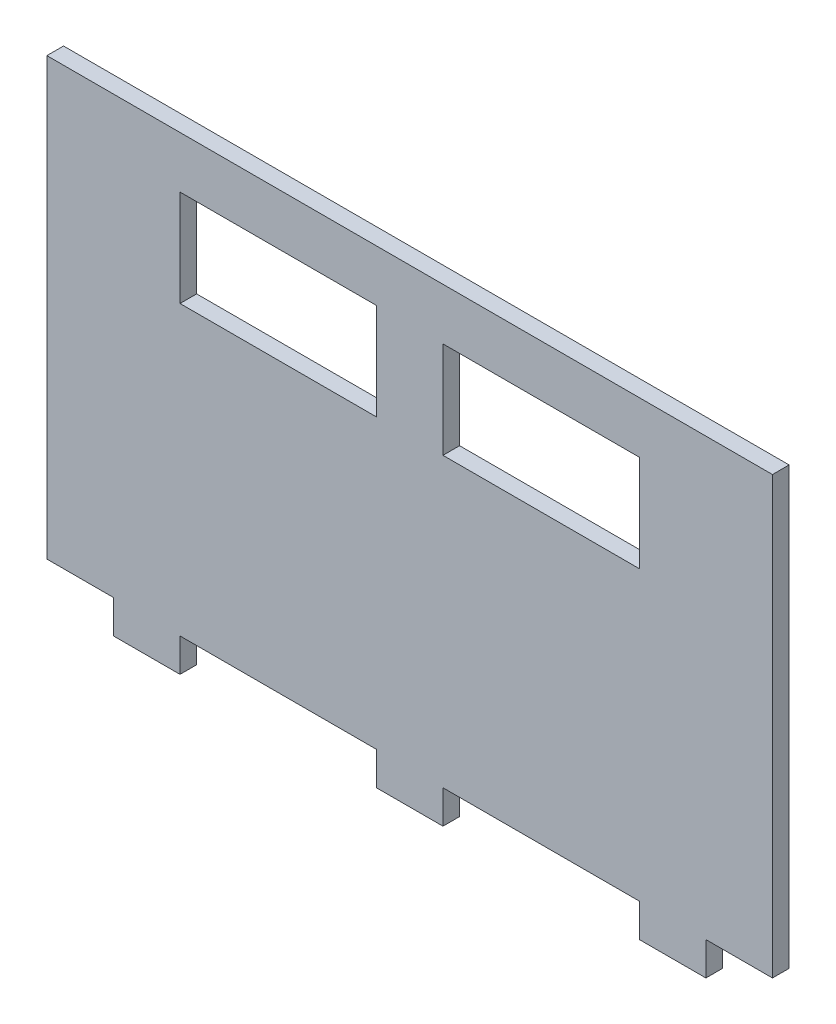
ISO-10303-21;
HEADER;
FILE_DESCRIPTION(('STEP AP214'),'2;1');
FILE_NAME('part.step','',(''),(''),'','','');
FILE_SCHEMA(('AUTOMOTIVE_DESIGN { 1 0 10303 214 1 1 1 1 }'));
ENDSEC;
DATA;
#1=APPLICATION_CONTEXT('core data for automotive mechanical design processes');
#2=APPLICATION_PROTOCOL_DEFINITION('international standard','automotive_design',2000,#1);
#3=PRODUCT_CONTEXT('',#1,'mechanical');
#4=PRODUCT('Part','Part','',(#3));
#5=PRODUCT_RELATED_PRODUCT_CATEGORY('part','',(#4));
#6=PRODUCT_DEFINITION_FORMATION('','',#4);
#7=PRODUCT_DEFINITION_CONTEXT('part definition',#1,'design');
#8=PRODUCT_DEFINITION('design','',#6,#7);
#9=PRODUCT_DEFINITION_SHAPE('','',#8);
#10=(LENGTH_UNIT() NAMED_UNIT(*) SI_UNIT(.MILLI.,.METRE.));
#11=(NAMED_UNIT(*) PLANE_ANGLE_UNIT() SI_UNIT($,.RADIAN.));
#12=(NAMED_UNIT(*) SI_UNIT($,.STERADIAN.) SOLID_ANGLE_UNIT());
#13=UNCERTAINTY_MEASURE_WITH_UNIT(LENGTH_MEASURE(1.E-05),#10,'distance_accuracy_value','');
#14=(GEOMETRIC_REPRESENTATION_CONTEXT(3) GLOBAL_UNCERTAINTY_ASSIGNED_CONTEXT((#13)) GLOBAL_UNIT_ASSIGNED_CONTEXT((#10,
#11,#12)) REPRESENTATION_CONTEXT('',''));
#15=CARTESIAN_POINT('',(0.,0.,0.));
#16=DIRECTION('',(0.,0.,1.));
#17=DIRECTION('',(1.,0.,0.));
#18=AXIS2_PLACEMENT_3D('',#15,#16,#17);
#19=CARTESIAN_POINT('',(0.,49.9999999999999,5.));
#20=DIRECTION('',(0.,1.,0.));
#21=DIRECTION('',(-1.,0.,0.));
#22=AXIS2_PLACEMENT_3D('',#19,#20,#21);
#23=PLANE('',#22);
#24=DIRECTION('',(1.,0.,0.));
#25=VECTOR('',#24,1.);
#26=CARTESIAN_POINT('',(0.,49.9999999999999,0.));
#27=LINE('',#26,#25);
#28=CARTESIAN_POINT('',(9.99999999999999,49.9999999999999,0.));
#29=VERTEX_POINT('',#28);
#30=CARTESIAN_POINT('',(69.,49.9999999999999,0.));
#31=VERTEX_POINT('',#30);
#32=EDGE_CURVE('E278',#29,#31,#27,.T.);
#33=ORIENTED_EDGE('',*,*,#32,.T.);
#34=DIRECTION('',(0.,0.,-1.));
#35=VECTOR('',#34,1.);
#36=CARTESIAN_POINT('',(69.,49.9999999999999,5.));
#37=LINE('',#36,#35);
#38=CARTESIAN_POINT('',(69.,49.9999999999999,5.));
#39=VERTEX_POINT('',#38);
#40=EDGE_CURVE('E11',#39,#31,#37,.T.);
#41=ORIENTED_EDGE('',*,*,#40,.F.);
#42=DIRECTION('',(1.,0.,0.));
#43=VECTOR('',#42,1.);
#44=CARTESIAN_POINT('',(0.,49.9999999999999,5.));
#45=LINE('',#44,#43);
#46=CARTESIAN_POINT('',(9.99999999999999,49.9999999999999,5.));
#47=VERTEX_POINT('',#46);
#48=EDGE_CURVE('E208',#47,#39,#45,.T.);
#49=ORIENTED_EDGE('',*,*,#48,.F.);
#50=DIRECTION('',(0.,0.,-1.));
#51=VECTOR('',#50,1.);
#52=CARTESIAN_POINT('',(9.99999999999999,49.9999999999999,5.));
#53=LINE('',#52,#51);
#54=EDGE_CURVE('E52',#47,#29,#53,.T.);
#55=ORIENTED_EDGE('',*,*,#54,.T.);
#56=EDGE_LOOP('',(#33,#41,#49,#55));
#57=FACE_BOUND('',#56,.T.);
#58=ADVANCED_FACE('F33',(#57),#23,.F.);
#59=CARTESIAN_POINT('',(69.,0.,5.));
#60=DIRECTION('',(1.,0.,0.));
#61=DIRECTION('',(0.,0.,-1.));
#62=AXIS2_PLACEMENT_3D('',#59,#60,#61);
#63=PLANE('',#62);
#64=DIRECTION('',(0.,-1.,0.));
#65=VECTOR('',#64,1.);
#66=CARTESIAN_POINT('',(69.,0.,0.));
#67=LINE('',#66,#65);
#68=CARTESIAN_POINT('',(69.,21.,0.));
#69=VERTEX_POINT('',#68);
#70=EDGE_CURVE('E214',#31,#69,#67,.T.);
#71=ORIENTED_EDGE('',*,*,#70,.T.);
#72=DIRECTION('',(0.,0.,-1.));
#73=VECTOR('',#72,1.);
#74=CARTESIAN_POINT('',(69.,21.,5.));
#75=LINE('',#74,#73);
#76=CARTESIAN_POINT('',(69.,21.,5.));
#77=VERTEX_POINT('',#76);
#78=EDGE_CURVE('E43',#77,#69,#75,.T.);
#79=ORIENTED_EDGE('',*,*,#78,.F.);
#80=DIRECTION('',(0.,-1.,0.));
#81=VECTOR('',#80,1.);
#82=CARTESIAN_POINT('',(69.,0.,5.));
#83=LINE('',#82,#81);
#84=EDGE_CURVE('E202',#39,#77,#83,.T.);
#85=ORIENTED_EDGE('',*,*,#84,.F.);
#86=ORIENTED_EDGE('',*,*,#40,.T.);
#87=EDGE_LOOP('',(#71,#79,#85,#86));
#88=FACE_BOUND('',#87,.T.);
#89=ADVANCED_FACE('F213',(#88),#63,.F.);
#90=CARTESIAN_POINT('',(0.,21.,5.));
#91=DIRECTION('',(0.,1.,0.));
#92=DIRECTION('',(0.,0.,1.));
#93=AXIS2_PLACEMENT_3D('',#90,#91,#92);
#94=PLANE('',#93);
#95=DIRECTION('',(1.,0.,0.));
#96=VECTOR('',#95,1.);
#97=CARTESIAN_POINT('',(0.,21.,0.));
#98=LINE('',#97,#96);
#99=CARTESIAN_POINT('',(10.,21.,0.));
#100=VERTEX_POINT('',#99);
#101=EDGE_CURVE('E281',#100,#69,#98,.T.);
#102=ORIENTED_EDGE('',*,*,#101,.F.);
#103=DIRECTION('',(0.,0.,-1.));
#104=VECTOR('',#103,1.);
#105=CARTESIAN_POINT('',(10.,21.,5.));
#106=LINE('',#105,#104);
#107=CARTESIAN_POINT('',(10.,21.,5.));
#108=VERTEX_POINT('',#107);
#109=EDGE_CURVE('E126',#108,#100,#106,.T.);
#110=ORIENTED_EDGE('',*,*,#109,.F.);
#111=DIRECTION('',(1.,0.,0.));
#112=VECTOR('',#111,1.);
#113=CARTESIAN_POINT('',(0.,21.,5.));
#114=LINE('',#113,#112);
#115=EDGE_CURVE('E207',#108,#77,#114,.T.);
#116=ORIENTED_EDGE('',*,*,#115,.T.);
#117=ORIENTED_EDGE('',*,*,#78,.T.);
#118=EDGE_LOOP('',(#102,#110,#116,#117));
#119=FACE_BOUND('',#118,.T.);
#120=ADVANCED_FACE('F218',(#119),#94,.T.);
#121=CARTESIAN_POINT('',(109.,0.,5.));
#122=DIRECTION('',(1.,0.,0.));
#123=DIRECTION('',(0.,1.,0.));
#124=AXIS2_PLACEMENT_3D('',#121,#122,#123);
#125=PLANE('',#124);
#126=DIRECTION('',(0.,-1.,0.));
#127=VECTOR('',#126,1.);
#128=CARTESIAN_POINT('',(109.,0.,0.));
#129=LINE('',#128,#127);
#130=CARTESIAN_POINT('',(109.,65.5,0.));
#131=VERTEX_POINT('',#130);
#132=CARTESIAN_POINT('',(109.,-65.5,0.));
#133=VERTEX_POINT('',#132);
#134=EDGE_CURVE('E236',#131,#133,#129,.T.);
#135=ORIENTED_EDGE('',*,*,#134,.F.);
#136=DIRECTION('',(0.,0.,-1.));
#137=VECTOR('',#136,1.);
#138=CARTESIAN_POINT('',(109.,65.5,5.));
#139=LINE('',#138,#137);
#140=CARTESIAN_POINT('',(109.,65.5,5.));
#141=VERTEX_POINT('',#140);
#142=EDGE_CURVE('E288',#141,#131,#139,.T.);
#143=ORIENTED_EDGE('',*,*,#142,.F.);
#144=DIRECTION('',(0.,-1.,0.));
#145=VECTOR('',#144,1.);
#146=CARTESIAN_POINT('',(109.,0.,5.));
#147=LINE('',#146,#145);
#148=CARTESIAN_POINT('',(109.,-65.5,5.));
#149=VERTEX_POINT('',#148);
#150=EDGE_CURVE('E353',#141,#149,#147,.T.);
#151=ORIENTED_EDGE('',*,*,#150,.T.);
#152=DIRECTION('',(0.,0.,-1.));
#153=VECTOR('',#152,1.);
#154=CARTESIAN_POINT('',(109.,-65.5,5.));
#155=LINE('',#154,#153);
#156=EDGE_CURVE('E290',#149,#133,#155,.T.);
#157=ORIENTED_EDGE('',*,*,#156,.T.);
#158=EDGE_LOOP('',(#135,#143,#151,#157));
#159=FACE_BOUND('',#158,.T.);
#160=ADVANCED_FACE('F441',(#159),#125,.T.);
#161=CARTESIAN_POINT('',(0.,65.5,5.));
#162=DIRECTION('',(0.,1.,0.));
#163=DIRECTION('',(0.,0.,1.));
#164=AXIS2_PLACEMENT_3D('',#161,#162,#163);
#165=PLANE('',#164);
#166=DIRECTION('',(1.,0.,0.));
#167=VECTOR('',#166,1.);
#168=CARTESIAN_POINT('',(0.,65.5,0.));
#169=LINE('',#168,#167);
#170=CARTESIAN_POINT('',(-109.,65.5,0.));
#171=VERTEX_POINT('',#170);
#172=EDGE_CURVE('E239',#171,#131,#169,.T.);
#173=ORIENTED_EDGE('',*,*,#172,.F.);
#174=DIRECTION('',(0.,0.,-1.));
#175=VECTOR('',#174,1.);
#176=CARTESIAN_POINT('',(-109.,65.5,5.));
#177=LINE('',#176,#175);
#178=CARTESIAN_POINT('',(-109.,65.5,5.));
#179=VERTEX_POINT('',#178);
#180=EDGE_CURVE('E325',#179,#171,#177,.T.);
#181=ORIENTED_EDGE('',*,*,#180,.F.);
#182=DIRECTION('',(1.,0.,0.));
#183=VECTOR('',#182,1.);
#184=CARTESIAN_POINT('',(0.,65.5,5.));
#185=LINE('',#184,#183);
#186=EDGE_CURVE('E357',#179,#141,#185,.T.);
#187=ORIENTED_EDGE('',*,*,#186,.T.);
#188=ORIENTED_EDGE('',*,*,#142,.T.);
#189=EDGE_LOOP('',(#173,#181,#187,#188));
#190=FACE_BOUND('',#189,.T.);
#191=ADVANCED_FACE('F445',(#190),#165,.T.);
#192=CARTESIAN_POINT('',(-109.,0.,5.));
#193=DIRECTION('',(1.,0.,0.));
#194=DIRECTION('',(0.,1.,0.));
#195=AXIS2_PLACEMENT_3D('',#192,#193,#194);
#196=PLANE('',#195);
#197=DIRECTION('',(0.,-1.,0.));
#198=VECTOR('',#197,1.);
#199=CARTESIAN_POINT('',(-109.,0.,0.));
#200=LINE('',#199,#198);
#201=CARTESIAN_POINT('',(-109.,-65.5,0.));
#202=VERTEX_POINT('',#201);
#203=EDGE_CURVE('E242',#171,#202,#200,.T.);
#204=ORIENTED_EDGE('',*,*,#203,.T.);
#205=DIRECTION('',(0.,0.,-1.));
#206=VECTOR('',#205,1.);
#207=CARTESIAN_POINT('',(-109.,-65.5,5.));
#208=LINE('',#207,#206);
#209=CARTESIAN_POINT('',(-109.,-65.5,5.));
#210=VERTEX_POINT('',#209);
#211=EDGE_CURVE('E322',#210,#202,#208,.T.);
#212=ORIENTED_EDGE('',*,*,#211,.F.);
#213=DIRECTION('',(0.,-1.,0.));
#214=VECTOR('',#213,1.);
#215=CARTESIAN_POINT('',(-109.,0.,5.));
#216=LINE('',#215,#214);
#217=EDGE_CURVE('E364',#179,#210,#216,.T.);
#218=ORIENTED_EDGE('',*,*,#217,.F.);
#219=ORIENTED_EDGE('',*,*,#180,.T.);
#220=EDGE_LOOP('',(#204,#212,#218,#219));
#221=FACE_BOUND('',#220,.T.);
#222=ADVANCED_FACE('F450',(#221),#196,.F.);
#223=CARTESIAN_POINT('',(0.,-65.5,5.));
#224=DIRECTION('',(0.,1.,0.));
#225=DIRECTION('',(0.,0.,1.));
#226=AXIS2_PLACEMENT_3D('',#223,#224,#225);
#227=PLANE('',#226);
#228=DIRECTION('',(1.,0.,0.));
#229=VECTOR('',#228,1.);
#230=CARTESIAN_POINT('',(0.,-65.5,0.));
#231=LINE('',#230,#229);
#232=CARTESIAN_POINT('',(-89.,-65.5,0.));
#233=VERTEX_POINT('',#232);
#234=EDGE_CURVE('E245',#202,#233,#231,.T.);
#235=ORIENTED_EDGE('',*,*,#234,.T.);
#236=DIRECTION('',(0.,0.,-1.));
#237=VECTOR('',#236,1.);
#238=CARTESIAN_POINT('',(-89.,-65.5,5.));
#239=LINE('',#238,#237);
#240=CARTESIAN_POINT('',(-89.,-65.5,5.));
#241=VERTEX_POINT('',#240);
#242=EDGE_CURVE('E319',#241,#233,#239,.T.);
#243=ORIENTED_EDGE('',*,*,#242,.F.);
#244=DIRECTION('',(1.,0.,0.));
#245=VECTOR('',#244,1.);
#246=CARTESIAN_POINT('',(0.,-65.5,5.));
#247=LINE('',#246,#245);
#248=EDGE_CURVE('E367',#210,#241,#247,.T.);
#249=ORIENTED_EDGE('',*,*,#248,.F.);
#250=ORIENTED_EDGE('',*,*,#211,.T.);
#251=EDGE_LOOP('',(#235,#243,#249,#250));
#252=FACE_BOUND('',#251,.T.);
#253=ADVANCED_FACE('F454',(#252),#227,.F.);
#254=CARTESIAN_POINT('',(-89.0000000000001,-1.11022302462516E-13,5.));
#255=DIRECTION('',(1.,0.,0.));
#256=DIRECTION('',(0.,1.,0.));
#257=AXIS2_PLACEMENT_3D('',#254,#255,#256);
#258=PLANE('',#257);
#259=DIRECTION('',(0.,-1.,0.));
#260=VECTOR('',#259,1.);
#261=CARTESIAN_POINT('',(-89.0000000000001,-1.11022302462516E-13,0.));
#262=LINE('',#261,#260);
#263=CARTESIAN_POINT('',(-89.,-75.5,0.));
#264=VERTEX_POINT('',#263);
#265=EDGE_CURVE('E248',#233,#264,#262,.T.);
#266=ORIENTED_EDGE('',*,*,#265,.T.);
#267=DIRECTION('',(0.,0.,-1.));
#268=VECTOR('',#267,1.);
#269=CARTESIAN_POINT('',(-89.,-75.5,5.));
#270=LINE('',#269,#268);
#271=CARTESIAN_POINT('',(-89.,-75.5,5.));
#272=VERTEX_POINT('',#271);
#273=EDGE_CURVE('E316',#272,#264,#270,.T.);
#274=ORIENTED_EDGE('',*,*,#273,.F.);
#275=DIRECTION('',(0.,-1.,0.));
#276=VECTOR('',#275,1.);
#277=CARTESIAN_POINT('',(-89.0000000000001,-1.11022302462516E-13,5.));
#278=LINE('',#277,#276);
#279=EDGE_CURVE('E370',#241,#272,#278,.T.);
#280=ORIENTED_EDGE('',*,*,#279,.F.);
#281=ORIENTED_EDGE('',*,*,#242,.T.);
#282=EDGE_LOOP('',(#266,#274,#280,#281));
#283=FACE_BOUND('',#282,.T.);
#284=ADVANCED_FACE('F456',(#283),#258,.F.);
#285=CARTESIAN_POINT('',(0.,-75.5,5.));
#286=DIRECTION('',(0.,1.,0.));
#287=DIRECTION('',(0.,0.,1.));
#288=AXIS2_PLACEMENT_3D('',#285,#286,#287);
#289=PLANE('',#288);
#290=DIRECTION('',(1.,0.,0.));
#291=VECTOR('',#290,1.);
#292=CARTESIAN_POINT('',(0.,-75.5,0.));
#293=LINE('',#292,#291);
#294=CARTESIAN_POINT('',(-69.,-75.5,0.));
#295=VERTEX_POINT('',#294);
#296=EDGE_CURVE('E253',#264,#295,#293,.T.);
#297=ORIENTED_EDGE('',*,*,#296,.T.);
#298=DIRECTION('',(0.,0.,-1.));
#299=VECTOR('',#298,1.);
#300=CARTESIAN_POINT('',(-69.,-75.5,5.));
#301=LINE('',#300,#299);
#302=CARTESIAN_POINT('',(-69.,-75.5,5.));
#303=VERTEX_POINT('',#302);
#304=EDGE_CURVE('E314',#303,#295,#301,.T.);
#305=ORIENTED_EDGE('',*,*,#304,.F.);
#306=DIRECTION('',(1.,0.,0.));
#307=VECTOR('',#306,1.);
#308=CARTESIAN_POINT('',(0.,-75.5,5.));
#309=LINE('',#308,#307);
#310=EDGE_CURVE('E375',#272,#303,#309,.T.);
#311=ORIENTED_EDGE('',*,*,#310,.F.);
#312=ORIENTED_EDGE('',*,*,#273,.T.);
#313=EDGE_LOOP('',(#297,#305,#311,#312));
#314=FACE_BOUND('',#313,.T.);
#315=ADVANCED_FACE('F458',(#314),#289,.F.);
#316=CARTESIAN_POINT('',(-69.,0.,5.));
#317=DIRECTION('',(1.,0.,0.));
#318=DIRECTION('',(0.,0.,-1.));
#319=AXIS2_PLACEMENT_3D('',#316,#317,#318);
#320=PLANE('',#319);
#321=DIRECTION('',(0.,-1.,0.));
#322=VECTOR('',#321,1.);
#323=CARTESIAN_POINT('',(-69.,0.,0.));
#324=LINE('',#323,#322);
#325=CARTESIAN_POINT('',(-69.,-65.5,0.));
#326=VERTEX_POINT('',#325);
#327=EDGE_CURVE('E256',#326,#295,#324,.T.);
#328=ORIENTED_EDGE('',*,*,#327,.F.);
#329=DIRECTION('',(0.,0.,-1.));
#330=VECTOR('',#329,1.);
#331=CARTESIAN_POINT('',(-69.,-65.5,5.));
#332=LINE('',#331,#330);
#333=CARTESIAN_POINT('',(-69.,-65.5,5.));
#334=VERTEX_POINT('',#333);
#335=EDGE_CURVE('E312',#334,#326,#332,.T.);
#336=ORIENTED_EDGE('',*,*,#335,.F.);
#337=DIRECTION('',(0.,-1.,0.));
#338=VECTOR('',#337,1.);
#339=CARTESIAN_POINT('',(-69.,0.,5.));
#340=LINE('',#339,#338);
#341=EDGE_CURVE('E377',#334,#303,#340,.T.);
#342=ORIENTED_EDGE('',*,*,#341,.T.);
#343=ORIENTED_EDGE('',*,*,#304,.T.);
#344=EDGE_LOOP('',(#328,#336,#342,#343));
#345=FACE_BOUND('',#344,.T.);
#346=ADVANCED_FACE('F462',(#345),#320,.T.);
#347=CARTESIAN_POINT('',(-9.99999999999999,-65.5,0.));
#348=VERTEX_POINT('',#347);
#349=EDGE_CURVE('E250',#326,#348,#231,.T.);
#350=ORIENTED_EDGE('',*,*,#349,.T.);
#351=DIRECTION('',(0.,0.,-1.));
#352=VECTOR('',#351,1.);
#353=CARTESIAN_POINT('',(-9.99999999999999,-65.5,5.));
#354=LINE('',#353,#352);
#355=CARTESIAN_POINT('',(-9.99999999999999,-65.5,5.));
#356=VERTEX_POINT('',#355);
#357=EDGE_CURVE('E309',#356,#348,#354,.T.);
#358=ORIENTED_EDGE('',*,*,#357,.F.);
#359=EDGE_CURVE('E372',#334,#356,#247,.T.);
#360=ORIENTED_EDGE('',*,*,#359,.F.);
#361=ORIENTED_EDGE('',*,*,#335,.T.);
#362=EDGE_LOOP('',(#350,#358,#360,#361));
#363=FACE_BOUND('',#362,.T.);
#364=ADVANCED_FACE('F412',(#363),#227,.F.);
#365=CARTESIAN_POINT('',(-9.99999999999991,0.,5.));
#366=DIRECTION('',(1.,0.,0.));
#367=DIRECTION('',(0.,1.,0.));
#368=AXIS2_PLACEMENT_3D('',#365,#366,#367);
#369=PLANE('',#368);
#370=DIRECTION('',(0.,-1.,0.));
#371=VECTOR('',#370,1.);
#372=CARTESIAN_POINT('',(-9.99999999999991,0.,0.));
#373=LINE('',#372,#371);
#374=CARTESIAN_POINT('',(-10.,-75.5,0.));
#375=VERTEX_POINT('',#374);
#376=EDGE_CURVE('E259',#348,#375,#373,.T.);
#377=ORIENTED_EDGE('',*,*,#376,.T.);
#378=DIRECTION('',(0.,0.,-1.));
#379=VECTOR('',#378,1.);
#380=CARTESIAN_POINT('',(-10.,-75.5,5.));
#381=LINE('',#380,#379);
#382=CARTESIAN_POINT('',(-10.,-75.5,5.));
#383=VERTEX_POINT('',#382);
#384=EDGE_CURVE('E306',#383,#375,#381,.T.);
#385=ORIENTED_EDGE('',*,*,#384,.F.);
#386=DIRECTION('',(0.,-1.,0.));
#387=VECTOR('',#386,1.);
#388=CARTESIAN_POINT('',(-9.99999999999991,0.,5.));
#389=LINE('',#388,#387);
#390=EDGE_CURVE('E380',#356,#383,#389,.T.);
#391=ORIENTED_EDGE('',*,*,#390,.F.);
#392=ORIENTED_EDGE('',*,*,#357,.T.);
#393=EDGE_LOOP('',(#377,#385,#391,#392));
#394=FACE_BOUND('',#393,.T.);
#395=ADVANCED_FACE('F415',(#394),#369,.F.);
#396=CARTESIAN_POINT('',(0.,-75.5,5.));
#397=DIRECTION('',(0.,1.,0.));
#398=DIRECTION('',(0.,0.,1.));
#399=AXIS2_PLACEMENT_3D('',#396,#397,#398);
#400=PLANE('',#399);
#401=DIRECTION('',(1.,0.,0.));
#402=VECTOR('',#401,1.);
#403=CARTESIAN_POINT('',(0.,-75.5,0.));
#404=LINE('',#403,#402);
#405=CARTESIAN_POINT('',(10.,-75.5,0.));
#406=VERTEX_POINT('',#405);
#407=EDGE_CURVE('E262',#375,#406,#404,.T.);
#408=ORIENTED_EDGE('',*,*,#407,.T.);
#409=DIRECTION('',(0.,0.,-1.));
#410=VECTOR('',#409,1.);
#411=CARTESIAN_POINT('',(10.,-75.5,5.));
#412=LINE('',#411,#410);
#413=CARTESIAN_POINT('',(10.,-75.5,5.));
#414=VERTEX_POINT('',#413);
#415=EDGE_CURVE('E304',#414,#406,#412,.T.);
#416=ORIENTED_EDGE('',*,*,#415,.F.);
#417=DIRECTION('',(1.,0.,0.));
#418=VECTOR('',#417,1.);
#419=CARTESIAN_POINT('',(0.,-75.5,5.));
#420=LINE('',#419,#418);
#421=EDGE_CURVE('E383',#383,#414,#420,.T.);
#422=ORIENTED_EDGE('',*,*,#421,.F.);
#423=ORIENTED_EDGE('',*,*,#384,.T.);
#424=EDGE_LOOP('',(#408,#416,#422,#423));
#425=FACE_BOUND('',#424,.T.);
#426=ADVANCED_FACE('F417',(#425),#400,.F.);
#427=CARTESIAN_POINT('',(9.99999999999997,0.,5.));
#428=DIRECTION('',(1.,0.,0.));
#429=DIRECTION('',(0.,1.,0.));
#430=AXIS2_PLACEMENT_3D('',#427,#428,#429);
#431=PLANE('',#430);
#432=DIRECTION('',(0.,-1.,0.));
#433=VECTOR('',#432,1.);
#434=CARTESIAN_POINT('',(9.99999999999997,0.,0.));
#435=LINE('',#434,#433);
#436=CARTESIAN_POINT('',(9.99999999999999,-65.5,0.));
#437=VERTEX_POINT('',#436);
#438=EDGE_CURVE('E265',#437,#406,#435,.T.);
#439=ORIENTED_EDGE('',*,*,#438,.F.);
#440=DIRECTION('',(0.,0.,-1.));
#441=VECTOR('',#440,1.);
#442=CARTESIAN_POINT('',(9.99999999999999,-65.5,5.));
#443=LINE('',#442,#441);
#444=CARTESIAN_POINT('',(9.99999999999999,-65.5,5.));
#445=VERTEX_POINT('',#444);
#446=EDGE_CURVE('E302',#445,#437,#443,.T.);
#447=ORIENTED_EDGE('',*,*,#446,.F.);
#448=DIRECTION('',(0.,-1.,0.));
#449=VECTOR('',#448,1.);
#450=CARTESIAN_POINT('',(9.99999999999997,0.,5.));
#451=LINE('',#450,#449);
#452=EDGE_CURVE('E385',#445,#414,#451,.T.);
#453=ORIENTED_EDGE('',*,*,#452,.T.);
#454=ORIENTED_EDGE('',*,*,#415,.T.);
#455=EDGE_LOOP('',(#439,#447,#453,#454));
#456=FACE_BOUND('',#455,.T.);
#457=ADVANCED_FACE('F421',(#456),#431,.T.);
#458=CARTESIAN_POINT('',(69.,-65.5,0.));
#459=VERTEX_POINT('',#458);
#460=EDGE_CURVE('E268',#437,#459,#231,.T.);
#461=ORIENTED_EDGE('',*,*,#460,.T.);
#462=DIRECTION('',(0.,0.,-1.));
#463=VECTOR('',#462,1.);
#464=CARTESIAN_POINT('',(69.,-65.5,5.));
#465=LINE('',#464,#463);
#466=CARTESIAN_POINT('',(69.,-65.5,5.));
#467=VERTEX_POINT('',#466);
#468=EDGE_CURVE('E299',#467,#459,#465,.T.);
#469=ORIENTED_EDGE('',*,*,#468,.F.);
#470=EDGE_CURVE('E388',#445,#467,#247,.T.);
#471=ORIENTED_EDGE('',*,*,#470,.F.);
#472=ORIENTED_EDGE('',*,*,#446,.T.);
#473=EDGE_LOOP('',(#461,#469,#471,#472));
#474=FACE_BOUND('',#473,.T.);
#475=ADVANCED_FACE('F425',(#474),#227,.F.);
#476=CARTESIAN_POINT('',(69.,0.,5.));
#477=DIRECTION('',(1.,0.,0.));
#478=DIRECTION('',(0.,0.,-1.));
#479=AXIS2_PLACEMENT_3D('',#476,#477,#478);
#480=PLANE('',#479);
#481=DIRECTION('',(0.,-1.,0.));
#482=VECTOR('',#481,1.);
#483=CARTESIAN_POINT('',(69.,0.,0.));
#484=LINE('',#483,#482);
#485=CARTESIAN_POINT('',(69.,-75.5,0.));
#486=VERTEX_POINT('',#485);
#487=EDGE_CURVE('E269',#459,#486,#484,.T.);
#488=ORIENTED_EDGE('',*,*,#487,.T.);
#489=DIRECTION('',(0.,0.,-1.));
#490=VECTOR('',#489,1.);
#491=CARTESIAN_POINT('',(69.,-75.5,5.));
#492=LINE('',#491,#490);
#493=CARTESIAN_POINT('',(69.,-75.5,5.));
#494=VERTEX_POINT('',#493);
#495=EDGE_CURVE('E296',#494,#486,#492,.T.);
#496=ORIENTED_EDGE('',*,*,#495,.F.);
#497=DIRECTION('',(0.,-1.,0.));
#498=VECTOR('',#497,1.);
#499=CARTESIAN_POINT('',(69.,0.,5.));
#500=LINE('',#499,#498);
#501=EDGE_CURVE('E389',#467,#494,#500,.T.);
#502=ORIENTED_EDGE('',*,*,#501,.F.);
#503=ORIENTED_EDGE('',*,*,#468,.T.);
#504=EDGE_LOOP('',(#488,#496,#502,#503));
#505=FACE_BOUND('',#504,.T.);
#506=ADVANCED_FACE('F427',(#505),#480,.F.);
#507=CARTESIAN_POINT('',(0.,-75.5,5.));
#508=DIRECTION('',(0.,1.,0.));
#509=DIRECTION('',(0.,0.,1.));
#510=AXIS2_PLACEMENT_3D('',#507,#508,#509);
#511=PLANE('',#510);
#512=DIRECTION('',(1.,0.,0.));
#513=VECTOR('',#512,1.);
#514=CARTESIAN_POINT('',(0.,-75.5,0.));
#515=LINE('',#514,#513);
#516=CARTESIAN_POINT('',(89.,-75.5,0.));
#517=VERTEX_POINT('',#516);
#518=EDGE_CURVE('E272',#486,#517,#515,.T.);
#519=ORIENTED_EDGE('',*,*,#518,.T.);
#520=DIRECTION('',(0.,0.,-1.));
#521=VECTOR('',#520,1.);
#522=CARTESIAN_POINT('',(89.,-75.5,5.));
#523=LINE('',#522,#521);
#524=CARTESIAN_POINT('',(89.,-75.5,5.));
#525=VERTEX_POINT('',#524);
#526=EDGE_CURVE('E294',#525,#517,#523,.T.);
#527=ORIENTED_EDGE('',*,*,#526,.F.);
#528=DIRECTION('',(1.,0.,0.));
#529=VECTOR('',#528,1.);
#530=CARTESIAN_POINT('',(0.,-75.5,5.));
#531=LINE('',#530,#529);
#532=EDGE_CURVE('E392',#494,#525,#531,.T.);
#533=ORIENTED_EDGE('',*,*,#532,.F.);
#534=ORIENTED_EDGE('',*,*,#495,.T.);
#535=EDGE_LOOP('',(#519,#527,#533,#534));
#536=FACE_BOUND('',#535,.T.);
#537=ADVANCED_FACE('F431',(#536),#511,.F.);
#538=CARTESIAN_POINT('',(89.0000000000001,-1.11022302462516E-13,5.));
#539=DIRECTION('',(1.,0.,0.));
#540=DIRECTION('',(0.,1.,0.));
#541=AXIS2_PLACEMENT_3D('',#538,#539,#540);
#542=PLANE('',#541);
#543=DIRECTION('',(0.,-1.,0.));
#544=VECTOR('',#543,1.);
#545=CARTESIAN_POINT('',(89.0000000000001,-1.11022302462516E-13,0.));
#546=LINE('',#545,#544);
#547=CARTESIAN_POINT('',(89.,-65.5,0.));
#548=VERTEX_POINT('',#547);
#549=EDGE_CURVE('E275',#548,#517,#546,.T.);
#550=ORIENTED_EDGE('',*,*,#549,.F.);
#551=DIRECTION('',(0.,0.,-1.));
#552=VECTOR('',#551,1.);
#553=CARTESIAN_POINT('',(89.,-65.5,5.));
#554=LINE('',#553,#552);
#555=CARTESIAN_POINT('',(89.,-65.5,5.));
#556=VERTEX_POINT('',#555);
#557=EDGE_CURVE('E292',#556,#548,#554,.T.);
#558=ORIENTED_EDGE('',*,*,#557,.F.);
#559=DIRECTION('',(0.,-1.,0.));
#560=VECTOR('',#559,1.);
#561=CARTESIAN_POINT('',(89.0000000000001,-1.11022302462516E-13,5.));
#562=LINE('',#561,#560);
#563=EDGE_CURVE('E394',#556,#525,#562,.T.);
#564=ORIENTED_EDGE('',*,*,#563,.T.);
#565=ORIENTED_EDGE('',*,*,#526,.T.);
#566=EDGE_LOOP('',(#550,#558,#564,#565));
#567=FACE_BOUND('',#566,.T.);
#568=ADVANCED_FACE('F434',(#567),#542,.T.);
#569=CARTESIAN_POINT('',(-9.99999999999999,0.,5.));
#570=DIRECTION('',(-1.,0.,0.));
#571=DIRECTION('',(0.,0.,1.));
#572=AXIS2_PLACEMENT_3D('',#569,#570,#571);
#573=PLANE('',#572);
#574=DIRECTION('',(0.,1.,0.));
#575=VECTOR('',#574,1.);
#576=CARTESIAN_POINT('',(-9.99999999999999,0.,0.));
#577=LINE('',#576,#575);
#578=CARTESIAN_POINT('',(-9.99999999999999,21.,0.));
#579=VERTEX_POINT('',#578);
#580=CARTESIAN_POINT('',(-9.99999999999999,49.9999999999999,0.));
#581=VERTEX_POINT('',#580);
#582=EDGE_CURVE('E225',#579,#581,#577,.T.);
#583=ORIENTED_EDGE('',*,*,#582,.F.);
#584=DIRECTION('',(0.,0.,-1.));
#585=VECTOR('',#584,1.);
#586=CARTESIAN_POINT('',(-9.99999999999999,21.,5.));
#587=LINE('',#586,#585);
#588=CARTESIAN_POINT('',(-9.99999999999999,21.,5.));
#589=VERTEX_POINT('',#588);
#590=EDGE_CURVE('E37',#589,#579,#587,.T.);
#591=ORIENTED_EDGE('',*,*,#590,.F.);
#592=DIRECTION('',(0.,1.,0.));
#593=VECTOR('',#592,1.);
#594=CARTESIAN_POINT('',(-9.99999999999999,0.,5.));
#595=LINE('',#594,#593);
#596=CARTESIAN_POINT('',(-9.99999999999999,49.9999999999999,5.));
#597=VERTEX_POINT('',#596);
#598=EDGE_CURVE('E286',#589,#597,#595,.T.);
#599=ORIENTED_EDGE('',*,*,#598,.T.);
#600=DIRECTION('',(0.,0.,-1.));
#601=VECTOR('',#600,1.);
#602=CARTESIAN_POINT('',(-9.99999999999999,49.9999999999999,5.));
#603=LINE('',#602,#601);
#604=EDGE_CURVE('E221',#597,#581,#603,.T.);
#605=ORIENTED_EDGE('',*,*,#604,.T.);
#606=EDGE_LOOP('',(#583,#591,#599,#605));
#607=FACE_BOUND('',#606,.T.);
#608=ADVANCED_FACE('F35',(#607),#573,.T.);
#609=CARTESIAN_POINT('',(0.,21.,5.));
#610=DIRECTION('',(0.,1.,0.));
#611=DIRECTION('',(0.,0.,1.));
#612=AXIS2_PLACEMENT_3D('',#609,#610,#611);
#613=PLANE('',#612);
#614=DIRECTION('',(1.,0.,0.));
#615=VECTOR('',#614,1.);
#616=CARTESIAN_POINT('',(0.,21.,0.));
#617=LINE('',#616,#615);
#618=CARTESIAN_POINT('',(-69.,21.,0.));
#619=VERTEX_POINT('',#618);
#620=EDGE_CURVE('E228',#619,#579,#617,.T.);
#621=ORIENTED_EDGE('',*,*,#620,.F.);
#622=DIRECTION('',(0.,0.,-1.));
#623=VECTOR('',#622,1.);
#624=CARTESIAN_POINT('',(-69.,21.,5.));
#625=LINE('',#624,#623);
#626=CARTESIAN_POINT('',(-69.,21.,5.));
#627=VERTEX_POINT('',#626);
#628=EDGE_CURVE('E331',#627,#619,#625,.T.);
#629=ORIENTED_EDGE('',*,*,#628,.F.);
#630=DIRECTION('',(1.,0.,0.));
#631=VECTOR('',#630,1.);
#632=CARTESIAN_POINT('',(0.,21.,5.));
#633=LINE('',#632,#631);
#634=EDGE_CURVE('E340',#627,#589,#633,.T.);
#635=ORIENTED_EDGE('',*,*,#634,.T.);
#636=ORIENTED_EDGE('',*,*,#590,.T.);
#637=EDGE_LOOP('',(#621,#629,#635,#636));
#638=FACE_BOUND('',#637,.T.);
#639=ADVANCED_FACE('F338',(#638),#613,.T.);
#640=CARTESIAN_POINT('',(-69.,0.,5.));
#641=DIRECTION('',(-1.,0.,0.));
#642=DIRECTION('',(0.,0.,1.));
#643=AXIS2_PLACEMENT_3D('',#640,#641,#642);
#644=PLANE('',#643);
#645=DIRECTION('',(0.,1.,0.));
#646=VECTOR('',#645,1.);
#647=CARTESIAN_POINT('',(-69.,0.,0.));
#648=LINE('',#647,#646);
#649=CARTESIAN_POINT('',(-69.,49.9999999999999,0.));
#650=VERTEX_POINT('',#649);
#651=EDGE_CURVE('E231',#619,#650,#648,.T.);
#652=ORIENTED_EDGE('',*,*,#651,.T.);
#653=DIRECTION('',(0.,0.,-1.));
#654=VECTOR('',#653,1.);
#655=CARTESIAN_POINT('',(-69.,49.9999999999999,5.));
#656=LINE('',#655,#654);
#657=CARTESIAN_POINT('',(-69.,49.9999999999999,5.));
#658=VERTEX_POINT('',#657);
#659=EDGE_CURVE('E329',#658,#650,#656,.T.);
#660=ORIENTED_EDGE('',*,*,#659,.F.);
#661=DIRECTION('',(0.,1.,0.));
#662=VECTOR('',#661,1.);
#663=CARTESIAN_POINT('',(-69.,0.,5.));
#664=LINE('',#663,#662);
#665=EDGE_CURVE('E354',#627,#658,#664,.T.);
#666=ORIENTED_EDGE('',*,*,#665,.F.);
#667=ORIENTED_EDGE('',*,*,#628,.T.);
#668=EDGE_LOOP('',(#652,#660,#666,#667));
#669=FACE_BOUND('',#668,.T.);
#670=ADVANCED_FACE('F347',(#669),#644,.F.);
#671=EDGE_CURVE('E249',#548,#133,#231,.T.);
#672=ORIENTED_EDGE('',*,*,#671,.T.);
#673=ORIENTED_EDGE('',*,*,#156,.F.);
#674=EDGE_CURVE('E371',#556,#149,#247,.T.);
#675=ORIENTED_EDGE('',*,*,#674,.F.);
#676=ORIENTED_EDGE('',*,*,#557,.T.);
#677=EDGE_LOOP('',(#672,#673,#675,#676));
#678=FACE_BOUND('',#677,.T.);
#679=ADVANCED_FACE('F438',(#678),#227,.F.);
#680=CARTESIAN_POINT('',(0.,49.9999999999999,5.));
#681=DIRECTION('',(0.,1.,0.));
#682=DIRECTION('',(-1.,0.,0.));
#683=AXIS2_PLACEMENT_3D('',#680,#681,#682);
#684=PLANE('',#683);
#685=DIRECTION('',(1.,0.,0.));
#686=VECTOR('',#685,1.);
#687=CARTESIAN_POINT('',(0.,49.9999999999999,0.));
#688=LINE('',#687,#686);
#689=EDGE_CURVE('E233',#650,#581,#688,.T.);
#690=ORIENTED_EDGE('',*,*,#689,.T.);
#691=ORIENTED_EDGE('',*,*,#604,.F.);
#692=DIRECTION('',(1.,0.,0.));
#693=VECTOR('',#692,1.);
#694=CARTESIAN_POINT('',(0.,49.9999999999999,5.));
#695=LINE('',#694,#693);
#696=EDGE_CURVE('E351',#658,#597,#695,.T.);
#697=ORIENTED_EDGE('',*,*,#696,.F.);
#698=ORIENTED_EDGE('',*,*,#659,.T.);
#699=EDGE_LOOP('',(#690,#691,#697,#698));
#700=FACE_BOUND('',#699,.T.);
#701=ADVANCED_FACE('F350',(#700),#684,.F.);
#702=CARTESIAN_POINT('',(10.,0.,5.));
#703=DIRECTION('',(1.,0.,0.));
#704=DIRECTION('',(0.,1.,0.));
#705=AXIS2_PLACEMENT_3D('',#702,#703,#704);
#706=PLANE('',#705);
#707=DIRECTION('',(0.,-1.,0.));
#708=VECTOR('',#707,1.);
#709=CARTESIAN_POINT('',(10.,0.,0.));
#710=LINE('',#709,#708);
#711=EDGE_CURVE('E283',#29,#100,#710,.T.);
#712=ORIENTED_EDGE('',*,*,#711,.F.);
#713=ORIENTED_EDGE('',*,*,#54,.F.);
#714=DIRECTION('',(0.,-1.,0.));
#715=VECTOR('',#714,1.);
#716=CARTESIAN_POINT('',(10.,0.,5.));
#717=LINE('',#716,#715);
#718=EDGE_CURVE('E219',#47,#108,#717,.T.);
#719=ORIENTED_EDGE('',*,*,#718,.T.);
#720=ORIENTED_EDGE('',*,*,#109,.T.);
#721=EDGE_LOOP('',(#712,#713,#719,#720));
#722=FACE_BOUND('',#721,.T.);
#723=ADVANCED_FACE('F466',(#722),#706,.T.);
#724=CARTESIAN_POINT('',(0.,0.,5.));
#725=DIRECTION('',(0.,0.,1.));
#726=DIRECTION('',(1.,0.,0.));
#727=AXIS2_PLACEMENT_3D('',#724,#725,#726);
#728=PLANE('',#727);
#729=ORIENTED_EDGE('',*,*,#598,.F.);
#730=ORIENTED_EDGE('',*,*,#634,.F.);
#731=ORIENTED_EDGE('',*,*,#665,.T.);
#732=ORIENTED_EDGE('',*,*,#696,.T.);
#733=EDGE_LOOP('',(#729,#730,#731,#732));
#734=FACE_BOUND('',#733,.T.);
#735=ORIENTED_EDGE('',*,*,#150,.F.);
#736=ORIENTED_EDGE('',*,*,#186,.F.);
#737=ORIENTED_EDGE('',*,*,#217,.T.);
#738=ORIENTED_EDGE('',*,*,#248,.T.);
#739=ORIENTED_EDGE('',*,*,#279,.T.);
#740=ORIENTED_EDGE('',*,*,#310,.T.);
#741=ORIENTED_EDGE('',*,*,#341,.F.);
#742=ORIENTED_EDGE('',*,*,#359,.T.);
#743=ORIENTED_EDGE('',*,*,#390,.T.);
#744=ORIENTED_EDGE('',*,*,#421,.T.);
#745=ORIENTED_EDGE('',*,*,#452,.F.);
#746=ORIENTED_EDGE('',*,*,#470,.T.);
#747=ORIENTED_EDGE('',*,*,#501,.T.);
#748=ORIENTED_EDGE('',*,*,#532,.T.);
#749=ORIENTED_EDGE('',*,*,#563,.F.);
#750=ORIENTED_EDGE('',*,*,#674,.T.);
#751=EDGE_LOOP('',(#735,#736,#737,#738,#739,#740,#741,#742,#743,#744,#745,#746,#747,#748,#749,#750));
#752=FACE_BOUND('',#751,.T.);
#753=ORIENTED_EDGE('',*,*,#48,.T.);
#754=ORIENTED_EDGE('',*,*,#84,.T.);
#755=ORIENTED_EDGE('',*,*,#115,.F.);
#756=ORIENTED_EDGE('',*,*,#718,.F.);
#757=EDGE_LOOP('',(#753,#754,#755,#756));
#758=FACE_BOUND('',#757,.T.);
#759=ADVANCED_FACE('F204',(#734,#752,#758),#728,.T.);
#760=CARTESIAN_POINT('',(0.,0.,0.));
#761=DIRECTION('',(0.,0.,1.));
#762=DIRECTION('',(1.,0.,0.));
#763=AXIS2_PLACEMENT_3D('',#760,#761,#762);
#764=PLANE('',#763);
#765=ORIENTED_EDGE('',*,*,#582,.T.);
#766=ORIENTED_EDGE('',*,*,#689,.F.);
#767=ORIENTED_EDGE('',*,*,#651,.F.);
#768=ORIENTED_EDGE('',*,*,#620,.T.);
#769=EDGE_LOOP('',(#765,#766,#767,#768));
#770=FACE_BOUND('',#769,.T.);
#771=ORIENTED_EDGE('',*,*,#134,.T.);
#772=ORIENTED_EDGE('',*,*,#671,.F.);
#773=ORIENTED_EDGE('',*,*,#549,.T.);
#774=ORIENTED_EDGE('',*,*,#518,.F.);
#775=ORIENTED_EDGE('',*,*,#487,.F.);
#776=ORIENTED_EDGE('',*,*,#460,.F.);
#777=ORIENTED_EDGE('',*,*,#438,.T.);
#778=ORIENTED_EDGE('',*,*,#407,.F.);
#779=ORIENTED_EDGE('',*,*,#376,.F.);
#780=ORIENTED_EDGE('',*,*,#349,.F.);
#781=ORIENTED_EDGE('',*,*,#327,.T.);
#782=ORIENTED_EDGE('',*,*,#296,.F.);
#783=ORIENTED_EDGE('',*,*,#265,.F.);
#784=ORIENTED_EDGE('',*,*,#234,.F.);
#785=ORIENTED_EDGE('',*,*,#203,.F.);
#786=ORIENTED_EDGE('',*,*,#172,.T.);
#787=EDGE_LOOP('',(#771,#772,#773,#774,#775,#776,#777,#778,#779,#780,#781,#782,#783,#784,#785,#786));
#788=FACE_BOUND('',#787,.T.);
#789=ORIENTED_EDGE('',*,*,#32,.F.);
#790=ORIENTED_EDGE('',*,*,#711,.T.);
#791=ORIENTED_EDGE('',*,*,#101,.T.);
#792=ORIENTED_EDGE('',*,*,#70,.F.);
#793=EDGE_LOOP('',(#789,#790,#791,#792));
#794=FACE_BOUND('',#793,.T.);
#795=ADVANCED_FACE('F344',(#770,#788,#794),#764,.F.);
#796=CLOSED_SHELL('',(#58,#89,#120,#160,#191,#222,#253,#284,#315,#346,#364,#395,#426,#457,#475,
#506,#537,#568,#608,#639,#670,#679,#701,#723,#759,#795));
#797=MANIFOLD_SOLID_BREP('B2',#796);
#798=ADVANCED_BREP_SHAPE_REPRESENTATION('',(#18,#797),#14);
#799=SHAPE_DEFINITION_REPRESENTATION(#9,#798);
ENDSEC;
END-ISO-10303-21;
